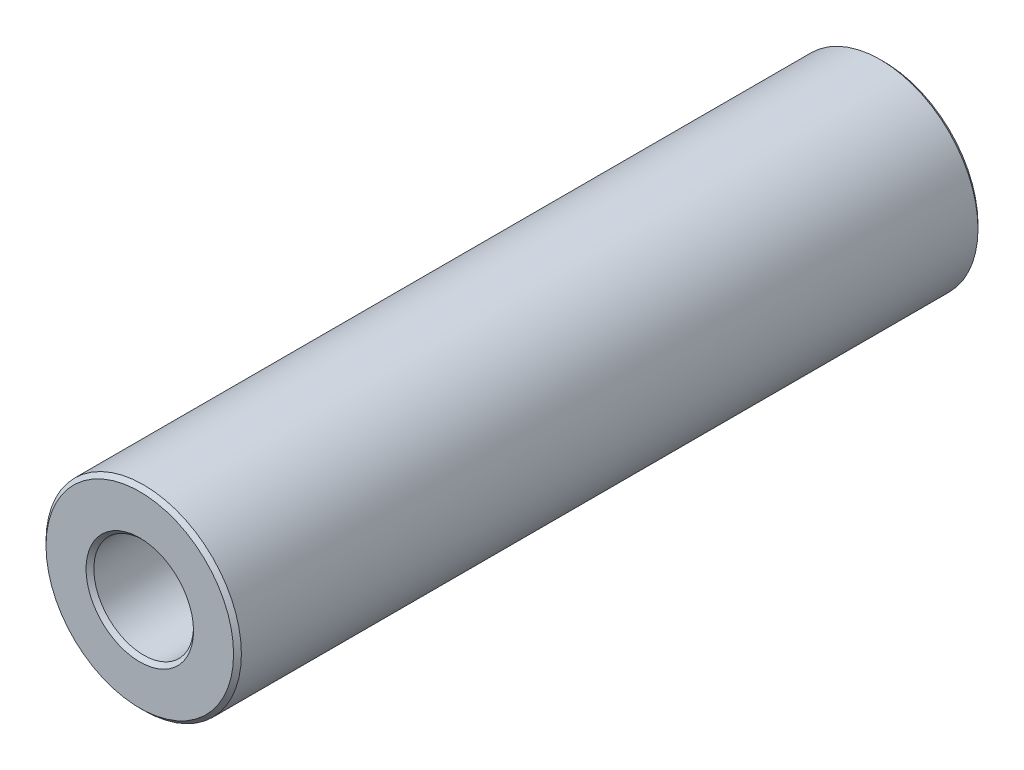
ISO-10303-21;
HEADER;
FILE_DESCRIPTION(('STEP AP214'),'2;1');
FILE_NAME('part.step','',(''),(''),'','','');
FILE_SCHEMA(('AUTOMOTIVE_DESIGN { 1 0 10303 214 1 1 1 1 }'));
ENDSEC;
DATA;
#1=APPLICATION_CONTEXT('core data for automotive mechanical design processes');
#2=APPLICATION_PROTOCOL_DEFINITION('international standard','automotive_design',2000,#1);
#3=PRODUCT_CONTEXT('',#1,'mechanical');
#4=PRODUCT('Part','Part','',(#3));
#5=PRODUCT_RELATED_PRODUCT_CATEGORY('part','',(#4));
#6=PRODUCT_DEFINITION_FORMATION('','',#4);
#7=PRODUCT_DEFINITION_CONTEXT('part definition',#1,'design');
#8=PRODUCT_DEFINITION('design','',#6,#7);
#9=PRODUCT_DEFINITION_SHAPE('','',#8);
#10=(LENGTH_UNIT() NAMED_UNIT(*) SI_UNIT(.MILLI.,.METRE.));
#11=(NAMED_UNIT(*) PLANE_ANGLE_UNIT() SI_UNIT($,.RADIAN.));
#12=(NAMED_UNIT(*) SI_UNIT($,.STERADIAN.) SOLID_ANGLE_UNIT());
#13=UNCERTAINTY_MEASURE_WITH_UNIT(LENGTH_MEASURE(1.E-05),#10,'distance_accuracy_value','');
#14=(GEOMETRIC_REPRESENTATION_CONTEXT(3) GLOBAL_UNCERTAINTY_ASSIGNED_CONTEXT((#13)) GLOBAL_UNIT_ASSIGNED_CONTEXT((#10,
#11,#12)) REPRESENTATION_CONTEXT('',''));
#15=CARTESIAN_POINT('',(0.,0.,0.));
#16=DIRECTION('',(0.,0.,1.));
#17=DIRECTION('',(1.,0.,0.));
#18=AXIS2_PLACEMENT_3D('',#15,#16,#17);
#19=CARTESIAN_POINT('',(0.,0.,38.1));
#20=DIRECTION('',(0.,0.,1.));
#21=DIRECTION('',(1.,0.,0.));
#22=AXIS2_PLACEMENT_3D('',#19,#20,#21);
#23=PLANE('',#22);
#24=CARTESIAN_POINT('',(0.,0.,38.1));
#25=DIRECTION('',(0.,0.,1.));
#26=DIRECTION('',(1.,0.,0.));
#27=AXIS2_PLACEMENT_3D('',#24,#25,#26);
#28=CIRCLE('',#27,2.75000000000003);
#29=CARTESIAN_POINT('',(2.75000000000003,0.,38.1));
#30=VERTEX_POINT('',#29);
#31=EDGE_CURVE('E10',#30,#30,#28,.F.);
#32=ORIENTED_EDGE('',*,*,#31,.T.);
#33=EDGE_LOOP('',(#32));
#34=FACE_BOUND('',#33,.T.);
#35=CARTESIAN_POINT('',(0.,0.,38.1));
#36=DIRECTION('',(0.,0.,1.));
#37=DIRECTION('',(1.,0.,0.));
#38=AXIS2_PLACEMENT_3D('',#35,#36,#37);
#39=CIRCLE('',#38,4.80000000000002);
#40=CARTESIAN_POINT('',(4.80000000000002,0.,38.1));
#41=VERTEX_POINT('',#40);
#42=EDGE_CURVE('E39',#41,#41,#39,.T.);
#43=ORIENTED_EDGE('',*,*,#42,.T.);
#44=EDGE_LOOP('',(#43));
#45=FACE_BOUND('',#44,.T.);
#46=ADVANCED_FACE('F32',(#34,#45),#23,.T.);
#47=CARTESIAN_POINT('',(0.,0.,0.));
#48=DIRECTION('',(0.,0.,1.));
#49=DIRECTION('',(1.,0.,0.));
#50=AXIS2_PLACEMENT_3D('',#47,#48,#49);
#51=PLANE('',#50);
#52=CARTESIAN_POINT('',(0.,0.,0.));
#53=DIRECTION('',(0.,0.,1.));
#54=DIRECTION('',(1.,0.,0.));
#55=AXIS2_PLACEMENT_3D('',#52,#53,#54);
#56=CIRCLE('',#55,4.79999999999997);
#57=CARTESIAN_POINT('',(4.79999999999997,0.,0.));
#58=VERTEX_POINT('',#57);
#59=EDGE_CURVE('E52',#58,#58,#56,.F.);
#60=ORIENTED_EDGE('',*,*,#59,.T.);
#61=EDGE_LOOP('',(#60));
#62=FACE_BOUND('',#61,.T.);
#63=CARTESIAN_POINT('',(0.,0.,0.));
#64=DIRECTION('',(0.,0.,1.));
#65=DIRECTION('',(1.,0.,0.));
#66=AXIS2_PLACEMENT_3D('',#63,#64,#65);
#67=CIRCLE('',#66,2.74999999999999);
#68=CARTESIAN_POINT('',(2.74999999999999,0.,0.));
#69=VERTEX_POINT('',#68);
#70=EDGE_CURVE('E55',#69,#69,#67,.T.);
#71=ORIENTED_EDGE('',*,*,#70,.T.);
#72=EDGE_LOOP('',(#71));
#73=FACE_BOUND('',#72,.T.);
#74=ADVANCED_FACE('F76',(#62,#73),#51,.F.);
#75=CARTESIAN_POINT('',(0.,0.,38.1));
#76=DIRECTION('',(0.,0.,-1.));
#77=DIRECTION('',(-1.,0.,0.));
#78=AXIS2_PLACEMENT_3D('',#75,#76,#77);
#79=CYLINDRICAL_SURFACE('',#78,5.);
#80=CARTESIAN_POINT('',(0.,0.,0.200000000000033));
#81=DIRECTION('',(0.,0.,1.));
#82=DIRECTION('',(1.,0.,0.));
#83=AXIS2_PLACEMENT_3D('',#80,#81,#82);
#84=CIRCLE('',#83,5.);
#85=CARTESIAN_POINT('',(5.,0.,0.200000000000033));
#86=VERTEX_POINT('',#85);
#87=EDGE_CURVE('E58',#86,#86,#84,.T.);
#88=ORIENTED_EDGE('',*,*,#87,.T.);
#89=EDGE_LOOP('',(#88));
#90=FACE_BOUND('',#89,.T.);
#91=CARTESIAN_POINT('',(0.,0.,37.9));
#92=DIRECTION('',(0.,0.,1.));
#93=DIRECTION('',(1.,0.,0.));
#94=AXIS2_PLACEMENT_3D('',#91,#92,#93);
#95=CIRCLE('',#94,5.);
#96=CARTESIAN_POINT('',(5.,0.,37.9));
#97=VERTEX_POINT('',#96);
#98=EDGE_CURVE('E61',#97,#97,#95,.F.);
#99=ORIENTED_EDGE('',*,*,#98,.T.);
#100=EDGE_LOOP('',(#99));
#101=FACE_BOUND('',#100,.T.);
#102=ADVANCED_FACE('F65',(#90,#101),#79,.T.);
#103=CARTESIAN_POINT('',(0.,0.,38.1));
#104=DIRECTION('',(0.,0.,-1.));
#105=DIRECTION('',(-1.,0.,0.));
#106=AXIS2_PLACEMENT_3D('',#103,#104,#105);
#107=CYLINDRICAL_SURFACE('',#106,2.55);
#108=CARTESIAN_POINT('',(0.,0.,0.199999999999992));
#109=DIRECTION('',(0.,0.,1.));
#110=DIRECTION('',(1.,0.,0.));
#111=AXIS2_PLACEMENT_3D('',#108,#109,#110);
#112=CIRCLE('',#111,2.55);
#113=CARTESIAN_POINT('',(2.55,0.,0.199999999999992));
#114=VERTEX_POINT('',#113);
#115=EDGE_CURVE('E43',#114,#114,#112,.F.);
#116=ORIENTED_EDGE('',*,*,#115,.T.);
#117=EDGE_LOOP('',(#116));
#118=FACE_BOUND('',#117,.T.);
#119=CARTESIAN_POINT('',(0.,0.,37.9));
#120=DIRECTION('',(0.,0.,1.));
#121=DIRECTION('',(1.,0.,0.));
#122=AXIS2_PLACEMENT_3D('',#119,#120,#121);
#123=CIRCLE('',#122,2.55);
#124=CARTESIAN_POINT('',(2.55,0.,37.9));
#125=VERTEX_POINT('',#124);
#126=EDGE_CURVE('E47',#125,#125,#123,.T.);
#127=ORIENTED_EDGE('',*,*,#126,.T.);
#128=EDGE_LOOP('',(#127));
#129=FACE_BOUND('',#128,.T.);
#130=ADVANCED_FACE('F84',(#118,#129),#107,.F.);
#131=CARTESIAN_POINT('',(0.,0.,0.200000000000027));
#132=DIRECTION('',(0.,0.,1.));
#133=DIRECTION('',(1.,0.,0.));
#134=AXIS2_PLACEMENT_3D('',#131,#132,#133);
#135=CONICAL_SURFACE('',#134,5.,0.785398163397448);
#136=ORIENTED_EDGE('',*,*,#59,.F.);
#137=EDGE_LOOP('',(#136));
#138=FACE_BOUND('',#137,.T.);
#139=ORIENTED_EDGE('',*,*,#87,.F.);
#140=EDGE_LOOP('',(#139));
#141=FACE_BOUND('',#140,.T.);
#142=ADVANCED_FACE('F89',(#138,#141),#135,.T.);
#143=CARTESIAN_POINT('',(0.,0.,0.));
#144=DIRECTION('',(0.,0.,-1.));
#145=DIRECTION('',(-1.,0.,0.));
#146=AXIS2_PLACEMENT_3D('',#143,#144,#145);
#147=CONICAL_SURFACE('',#146,2.74999999999999,0.785398163397448);
#148=ORIENTED_EDGE('',*,*,#115,.F.);
#149=EDGE_LOOP('',(#148));
#150=FACE_BOUND('',#149,.T.);
#151=ORIENTED_EDGE('',*,*,#70,.F.);
#152=EDGE_LOOP('',(#151));
#153=FACE_BOUND('',#152,.T.);
#154=ADVANCED_FACE('F73',(#150,#153),#147,.F.);
#155=CARTESIAN_POINT('',(0.,0.,37.9));
#156=DIRECTION('',(0.,0.,1.));
#157=DIRECTION('',(1.,0.,0.));
#158=AXIS2_PLACEMENT_3D('',#155,#156,#157);
#159=CONICAL_SURFACE('',#158,2.55,0.785398163397466);
#160=ORIENTED_EDGE('',*,*,#31,.F.);
#161=EDGE_LOOP('',(#160));
#162=FACE_BOUND('',#161,.T.);
#163=ORIENTED_EDGE('',*,*,#126,.F.);
#164=EDGE_LOOP('',(#163));
#165=FACE_BOUND('',#164,.T.);
#166=ADVANCED_FACE('F69',(#162,#165),#159,.F.);
#167=CARTESIAN_POINT('',(0.,0.,38.1));
#168=DIRECTION('',(0.,0.,-1.));
#169=DIRECTION('',(-1.,0.,0.));
#170=AXIS2_PLACEMENT_3D('',#167,#168,#169);
#171=CONICAL_SURFACE('',#170,4.80000000000002,0.785398163397448);
#172=ORIENTED_EDGE('',*,*,#98,.F.);
#173=EDGE_LOOP('',(#172));
#174=FACE_BOUND('',#173,.T.);
#175=ORIENTED_EDGE('',*,*,#42,.F.);
#176=EDGE_LOOP('',(#175));
#177=FACE_BOUND('',#176,.T.);
#178=ADVANCED_FACE('F34',(#174,#177),#171,.T.);
#179=CLOSED_SHELL('',(#46,#74,#102,#130,#142,#154,#166,#178));
#180=MANIFOLD_SOLID_BREP('B2',#179);
#181=ADVANCED_BREP_SHAPE_REPRESENTATION('',(#18,#180),#14);
#182=SHAPE_DEFINITION_REPRESENTATION(#9,#181);
ENDSEC;
END-ISO-10303-21;
